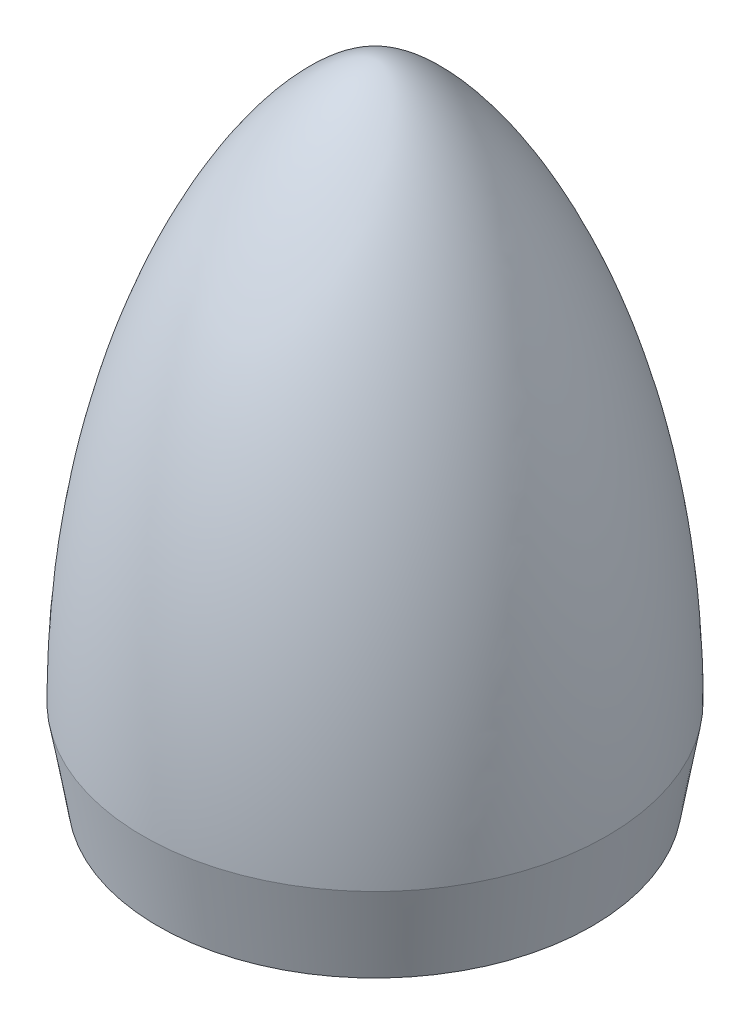
ISO-10303-21;
HEADER;
FILE_DESCRIPTION(('STEP AP214'),'2;1');
FILE_NAME('part.step','',(''),(''),'','','');
FILE_SCHEMA(('AUTOMOTIVE_DESIGN { 1 0 10303 214 1 1 1 1 }'));
ENDSEC;
DATA;
#1=APPLICATION_CONTEXT('core data for automotive mechanical design processes');
#2=APPLICATION_PROTOCOL_DEFINITION('international standard','automotive_design',2000,#1);
#3=PRODUCT_CONTEXT('',#1,'mechanical');
#4=PRODUCT('Part','Part','',(#3));
#5=PRODUCT_RELATED_PRODUCT_CATEGORY('part','',(#4));
#6=PRODUCT_DEFINITION_FORMATION('','',#4);
#7=PRODUCT_DEFINITION_CONTEXT('part definition',#1,'design');
#8=PRODUCT_DEFINITION('design','',#6,#7);
#9=PRODUCT_DEFINITION_SHAPE('','',#8);
#10=(LENGTH_UNIT() NAMED_UNIT(*) SI_UNIT(.MILLI.,.METRE.));
#11=(NAMED_UNIT(*) PLANE_ANGLE_UNIT() SI_UNIT($,.RADIAN.));
#12=(NAMED_UNIT(*) SI_UNIT($,.STERADIAN.) SOLID_ANGLE_UNIT());
#13=UNCERTAINTY_MEASURE_WITH_UNIT(LENGTH_MEASURE(1.E-05),#10,'distance_accuracy_value','');
#14=(GEOMETRIC_REPRESENTATION_CONTEXT(3) GLOBAL_UNCERTAINTY_ASSIGNED_CONTEXT((#13)) GLOBAL_UNIT_ASSIGNED_CONTEXT((#10,
#11,#12)) REPRESENTATION_CONTEXT('',''));
#15=CARTESIAN_POINT('',(0.,0.,0.));
#16=DIRECTION('',(0.,0.,1.));
#17=DIRECTION('',(1.,0.,0.));
#18=AXIS2_PLACEMENT_3D('',#15,#16,#17);
#19=CARTESIAN_POINT('',(0.,75.,0.));
#20=CARTESIAN_POINT('',(8.33333333333328,75.,0.));
#21=CARTESIAN_POINT('',(27.125,50.0000000000008,0.));
#22=CARTESIAN_POINT('',(27.125,9.99999999999995,0.));
#23=(BOUNDED_CURVE() B_SPLINE_CURVE(3,(#19,#20,#21,#22),.UNSPECIFIED.,.F.,
.F.) B_SPLINE_CURVE_WITH_KNOTS((4,4),(0.,1.),
.UNSPECIFIED.) CURVE() GEOMETRIC_REPRESENTATION_ITEM() RATIONAL_B_SPLINE_CURVE((1.,1.,1.,1.)) REPRESENTATION_ITEM(''));
#24=CARTESIAN_POINT('',(0.,75.,0.));
#25=DIRECTION('',(0.,-1.,0.));
#26=AXIS1_PLACEMENT('',#24,#25);
#27=SURFACE_OF_REVOLUTION('',#23,#26);
#28=OFFSET_SURFACE('',#27,-1.2,.F.);
#29=CARTESIAN_POINT('',(25.9056636611952,10.1039640318344,-1.00000000000001));
#30=CARTESIAN_POINT('',(25.9047739578221,11.1851292994955,-1.));
#31=CARTESIAN_POINT('',(25.89000684149,12.2662989602197,-1.));
#32=CARTESIAN_POINT('',(25.8321269391625,14.4301177234149,-0.999999999999999));
#33=CARTESIAN_POINT('',(25.7889555122232,15.5127652525866,-1.));
#34=CARTESIAN_POINT('',(25.6735874780133,17.678174263199,-1.));
#35=CARTESIAN_POINT('',(25.6013467457442,18.7609334047759,-1.));
#36=CARTESIAN_POINT('',(25.4272065567868,20.9251916612601,-1.));
#37=CARTESIAN_POINT('',(25.3252766279566,22.0066883296057,-1.));
#38=CARTESIAN_POINT('',(25.0911603567957,24.1670535457131,-1.));
#39=CARTESIAN_POINT('',(24.9589562111186,25.2459201680282,-1.));
#40=CARTESIAN_POINT('',(24.6637161605705,27.3996566798357,-1.));
#41=CARTESIAN_POINT('',(24.5006739761449,28.4745257097628,-1.));
#42=CARTESIAN_POINT('',(24.1396696088238,30.6400005591051,-1.));
#43=CARTESIAN_POINT('',(23.9410869927761,31.7305031577274,-1.));
#44=CARTESIAN_POINT('',(23.5106363113291,33.9045338260615,-1.));
#45=CARTESIAN_POINT('',(23.2787798575827,34.9880641916387,-1.));
#46=CARTESIAN_POINT('',(22.7810934389629,37.1467220348923,-1.));
#47=CARTESIAN_POINT('',(22.5152809145772,38.2218535276659,-1.));
#48=CARTESIAN_POINT('',(21.9488971595372,40.3622612287423,-1.));
#49=CARTESIAN_POINT('',(21.6483464406465,41.4275428557591,-1.));
#50=CARTESIAN_POINT('',(21.0115483611324,43.5467523215895,-0.999999999999999));
#51=CARTESIAN_POINT('',(20.6753208661929,44.6006861227439,-0.999999999999996));
#52=CARTESIAN_POINT('',(19.965988792542,46.695669129248,-1.));
#53=CARTESIAN_POINT('',(19.5928981302708,47.7367230312216,-1.00000000000002));
#54=CARTESIAN_POINT('',(18.9111355524333,49.5333072519622,-1.00000000000001));
#55=CARTESIAN_POINT('',(18.6112058890406,50.2921637450608,-1.));
#56=CARTESIAN_POINT('',(17.9897302408316,51.8009916872855,-0.999999999999997));
#57=CARTESIAN_POINT('',(17.6681842744349,52.5509631439819,-0.999999999999999));
#58=CARTESIAN_POINT('',(17.0025836747346,54.0410356529342,-1.));
#59=CARTESIAN_POINT('',(16.6585247368446,54.7811347847961,-1.));
#60=CARTESIAN_POINT('',(15.9467460013647,56.250376597967,-1.));
#61=CARTESIAN_POINT('',(15.5790136034461,56.9795131854377,-1.));
#62=CARTESIAN_POINT('',(14.8196738010202,58.4231147454467,-1.));
#63=CARTESIAN_POINT('',(14.4281238366581,59.1376098628833,-1.));
#64=CARTESIAN_POINT('',(13.6188223789997,60.5515715118866,-1.));
#65=CARTESIAN_POINT('',(13.2010725008175,61.2510389662835,-1.));
#66=CARTESIAN_POINT('',(12.337579357666,62.6318971885688,-1.));
#67=CARTESIAN_POINT('',(11.8918560160628,63.3133003411462,-1.));
#68=CARTESIAN_POINT('',(11.2002241923074,64.3191585320373,-1.));
#69=CARTESIAN_POINT('',(10.965922598767,64.6516266800612,-1.));
#70=CARTESIAN_POINT('',(10.489138756856,65.3106370330911,-1.));
#71=CARTESIAN_POINT('',(10.2466568465202,65.6371794821092,-1.));
#72=CARTESIAN_POINT('',(9.72104670420797,66.3254689731988,-1.));
#73=CARTESIAN_POINT('',(9.4367195090532,66.6863027051402,-1.));
#74=CARTESIAN_POINT('',(8.85602267824055,67.3982550839268,-1.));
#75=CARTESIAN_POINT('',(8.55965140573687,67.7493723992929,-1.));
#76=CARTESIAN_POINT('',(7.95353890224973,68.440374122446,-1.));
#77=CARTESIAN_POINT('',(7.64378763282018,68.7802497462721,-1.));
#78=CARTESIAN_POINT('',(7.0110636562642,69.4446905939281,-1.));
#79=CARTESIAN_POINT('',(6.68815587131408,69.7693171824537,-1.));
#80=CARTESIAN_POINT('',(6.19163053242581,70.2433321308816,-1.));
#81=CARTESIAN_POINT('',(6.02413242772628,70.3991505871125,-1.));
#82=CARTESIAN_POINT('',(5.68475706169596,70.7059348156969,-1.));
#83=CARTESIAN_POINT('',(5.51288010206683,70.8569009207637,-1.));
#84=CARTESIAN_POINT('',(5.16460709759994,71.1531207675309,-1.));
#85=CARTESIAN_POINT('',(4.9882165543557,71.2983809631444,-1.));
#86=CARTESIAN_POINT('',(4.63035021829058,71.5824712691468,-1.));
#87=CARTESIAN_POINT('',(4.44887502174878,71.7213021284827,-1.));
#88=CARTESIAN_POINT('',(4.07540057186857,71.995035449687,-1.));
#89=CARTESIAN_POINT('',(3.88324954641722,72.1297318940581,-1.));
#90=CARTESIAN_POINT('',(3.49244950352492,72.3895028121724,-1.));
#91=CARTESIAN_POINT('',(3.29379878285523,72.5145747345833,-1.));
#92=CARTESIAN_POINT('',(2.88918360745163,72.7528426831985,-1.));
#93=CARTESIAN_POINT('',(2.68321341586992,72.8660291062032,-1.));
#94=CARTESIAN_POINT('',(2.36847365439432,73.0241557935636,-1.));
#95=CARTESIAN_POINT('',(2.26261668941317,73.0749141151302,-1.));
#96=CARTESIAN_POINT('',(2.04887880663898,73.1719570760407,-1.));
#97=CARTESIAN_POINT('',(1.940998184409,73.2182423627067,-1.));
#98=CARTESIAN_POINT('',(1.70958409607399,73.3110666657054,-1.));
#99=CARTESIAN_POINT('',(1.58577330785383,73.3569205617637,-1.));
#100=CARTESIAN_POINT('',(1.33553827622287,73.4407502162384,-1.));
#101=CARTESIAN_POINT('',(1.20911511620819,73.478729171181,-1.));
#102=CARTESIAN_POINT('',(0.954495143604121,73.5449874784573,-1.));
#103=CARTESIAN_POINT('',(0.82631283312375,73.5733217023708,-1.));
#104=CARTESIAN_POINT('',(0.567938063143574,73.6186376117928,-1.));
#105=CARTESIAN_POINT('',(0.43774643034824,73.6356238452357,-1.));
#106=CARTESIAN_POINT('',(0.218728150607686,73.6531232062654,-1.));
#107=CARTESIAN_POINT('',(0.130178735759265,73.6571920582875,-1.));
#108=CARTESIAN_POINT('',(-0.047018203675013,73.6591241864253,-1.));
#109=CARTESIAN_POINT('',(-0.135665748312728,73.6569857845799,-1.));
#110=CARTESIAN_POINT('',(-0.312584033550978,73.6466295228109,-1.));
#111=CARTESIAN_POINT('',(-0.400854827213615,73.6384125494652,-1.));
#112=CARTESIAN_POINT('',(-0.577099842838167,73.6162956347007,-1.));
#113=CARTESIAN_POINT('',(-0.665070626945435,73.6023686997567,-1.));
#114=CARTESIAN_POINT('',(-0.840061090438921,73.5694229016164,-1.));
#115=CARTESIAN_POINT('',(-0.927080575384761,73.5504030169788,-1.));
#116=CARTESIAN_POINT('',(-1.10002301297835,73.5078695150568,-1.));
#117=CARTESIAN_POINT('',(-1.18594570966977,73.4843548685721,-1.));
#118=CARTESIAN_POINT('',(-1.40673022816087,73.4184145302641,-1.));
#119=CARTESIAN_POINT('',(-1.54069942030774,73.3729927504121,-1.));
#120=CARTESIAN_POINT('',(-1.80561365348659,73.2740199013044,-1.));
#121=CARTESIAN_POINT('',(-1.93655745970379,73.2204655779885,-1.));
#122=CARTESIAN_POINT('',(-2.19549277557048,73.1066004889257,-1.));
#123=CARTESIAN_POINT('',(-2.32348358490336,73.0462881399459,-1.));
#124=CARTESIAN_POINT('',(-2.57692929880701,72.9198200623486,-1.));
#125=CARTESIAN_POINT('',(-2.70237704535331,72.8536500702756,-1.));
#126=CARTESIAN_POINT('',(-2.95051503245612,72.7164505838075,-1.));
#127=CARTESIAN_POINT('',(-3.07320628875075,72.6454229197673,-1.));
#128=CARTESIAN_POINT('',(-3.31602472845425,72.4991431940919,-0.999999999999999));
#129=CARTESIAN_POINT('',(-3.43615205408969,72.4238913676247,-0.999999999999998));
#130=CARTESIAN_POINT('',(-3.73186925446334,72.2321691026222,-0.999999999999997));
#131=CARTESIAN_POINT('',(-3.90600751278708,72.1134576963422,-0.999999999999999));
#132=CARTESIAN_POINT('',(-4.24943012223542,71.8691813477923,-1.));
#133=CARTESIAN_POINT('',(-4.41871353593966,71.7436150953328,-1.));
#134=CARTESIAN_POINT('',(-4.75302096460449,71.4864661521654,-1.));
#135=CARTESIAN_POINT('',(-4.91803858353854,71.3548751637407,-1.));
#136=CARTESIAN_POINT('',(-5.24390296385264,71.0866168062875,-1.));
#137=CARTESIAN_POINT('',(-5.40474936053582,70.9499489959081,-1.));
#138=CARTESIAN_POINT('',(-5.88166415507493,70.5331250220563,-1.));
#139=CARTESIAN_POINT('',(-6.19191858470839,70.2462961971445,-1.));
#140=CARTESIAN_POINT('',(-6.79975157706936,69.657613454898,-1.));
#141=CARTESIAN_POINT('',(-7.09728363795676,69.355711929589,-0.999999999999999));
#142=CARTESIAN_POINT('',(-7.67973284756207,68.7405711466745,-1.));
#143=CARTESIAN_POINT('',(-7.9646621474796,68.4273433637191,-1.));
#144=CARTESIAN_POINT('',(-8.52328004018828,67.7911716571157,-0.999999999999998));
#145=CARTESIAN_POINT('',(-8.79697107644563,67.4682298722628,-0.999999999999991));
#146=CARTESIAN_POINT('',(-9.33590363177225,66.8117095975805,-0.999999999999991));
#147=CARTESIAN_POINT('',(-9.60107517023614,66.4780737785493,-0.999999999999998));
#148=CARTESIAN_POINT('',(-10.1217661738688,65.8033321580894,-1.));
#149=CARTESIAN_POINT('',(-10.3772849916799,65.4622258580693,-1.));
#150=CARTESIAN_POINT('',(-10.8795251857571,64.7730663861623,-0.999999999999999));
#151=CARTESIAN_POINT('',(-11.1262372321172,64.4250064225771,-1.));
#152=CARTESIAN_POINT('',(-11.6111009251128,63.7229666090582,-1.));
#153=CARTESIAN_POINT('',(-11.8492521934796,63.3689864985454,-1.));
#154=CARTESIAN_POINT('',(-12.5519791123531,62.2983643790201,-1.));
#155=CARTESIAN_POINT('',(-13.0043617043104,61.573684856381,-1.));
#156=CARTESIAN_POINT('',(-13.8793440107584,60.1065602896436,-1.));
#157=CARTESIAN_POINT('',(-14.3019405208713,59.3641133456053,-1.));
#158=CARTESIAN_POINT('',(-15.1201327932036,57.8626961766781,-1.));
#159=CARTESIAN_POINT('',(-15.5156761540113,57.1036974418436,-1.));
#160=CARTESIAN_POINT('',(-16.2801739807046,55.5731996250319,-1.));
#161=CARTESIAN_POINT('',(-16.6491490689552,54.8017108202861,-1.));
#162=CARTESIAN_POINT('',(-17.3620078504334,53.2475126458075,-1.));
#163=CARTESIAN_POINT('',(-17.7058987392067,52.4648065715074,-1.));
#164=CARTESIAN_POINT('',(-18.3697238586118,50.8893041120879,-0.999999999999999));
#165=CARTESIAN_POINT('',(-18.6896576791083,50.0965075544952,-0.999999999999995));
#166=CARTESIAN_POINT('',(-19.3390138069924,48.4176674392677,-0.999999999999995));
#167=CARTESIAN_POINT('',(-19.6658625529707,47.5306277905871,-0.999999999999999));
#168=CARTESIAN_POINT('',(-20.2922338493814,45.7469322753983,-1.));
#169=CARTESIAN_POINT('',(-20.591754587495,44.850275775527,-1.));
#170=CARTESIAN_POINT('',(-21.4508779385059,42.1465358881882,-0.999999999999999));
#171=CARTESIAN_POINT('',(-21.9706672657314,40.3266575105739,-1.));
#172=CARTESIAN_POINT('',(-22.909147984305,36.6606518030047,-1.));
#173=CARTESIAN_POINT('',(-23.3278067697762,34.8145162099632,-1.));
#174=CARTESIAN_POINT('',(-24.067266847634,31.1056334834027,-1.));
#175=CARTESIAN_POINT('',(-24.388212143806,29.2429149996989,-1.));
#176=CARTESIAN_POINT('',(-24.9363194758353,25.5045655893478,-0.999999999999999));
#177=CARTESIAN_POINT('',(-25.1635179957877,23.6289399753363,-0.999999999999997));
#178=CARTESIAN_POINT('',(-25.5272649721468,19.8697478763604,-1.));
#179=CARTESIAN_POINT('',(-25.6638538506106,17.9861853100838,-1.00000000000001));
#180=CARTESIAN_POINT('',(-25.8058026113443,15.1012031574367,-1.00000000000001));
#181=CARTESIAN_POINT('',(-25.8426675421309,14.1012251756996,-1.));
#182=CARTESIAN_POINT('',(-25.892168124827,12.1021648156403,-0.999999999999998));
#183=CARTESIAN_POINT('',(-25.9048399402877,11.1030833353799,-0.999999999999998));
#184=CARTESIAN_POINT('',(-25.9056636611953,10.1039640318345,-1.00000000000001));
#185=B_SPLINE_CURVE_WITH_KNOTS('',3,(#29,#30,#31,#32,#33,#34,#35,#36,#37,#38,#39,#40,#41,#42,
#43,#44,#45,#46,#47,#48,#49,#50,#51,#52,#53,#54,#55,#56,#57,#58,#59,#60,#61,#62,#63,#64,#65,#66,
#67,#68,#69,#70,#71,#72,#73,#74,#75,#76,#77,#78,#79,#80,#81,#82,#83,#84,#85,#86,#87,#88,#89,#90,
#91,#92,#93,#94,#95,#96,#97,#98,#99,#100,#101,#102,#103,#104,#105,#106,#107,#108,#109,#110,#111,
#112,#113,#114,#115,#116,#117,#118,#119,#120,#121,#122,#123,#124,#125,#126,#127,#128,#129,#130,
#131,#132,#133,#134,#135,#136,#137,#138,#139,#140,#141,#142,#143,#144,#145,#146,#147,#148,#149,
#150,#151,#152,#153,#154,#155,#156,#157,#158,#159,#160,#161,#162,#163,#164,#165,#166,#167,#168,
#169,#170,#171,#172,#173,#174,#175,#176,#177,#178,#179,#180,#181,#182,#183,#184),.UNSPECIFIED.,
.F.,.F.,(4,2,2,2,2,2,2,2,2,2,2,2,2,2,2,2,2,2,2,2,2,2,2,2,2,2,2,2,2,2,2,2,2,2,2,2,2,2,2,2,2,2,2,
2,2,2,2,2,2,2,2,2,2,2,2,2,2,2,2,2,2,2,2,2,2,2,2,2,2,2,2,2,2,2,2,2,2,4),(0.,3.24343134704531,
6.49357988613179,9.74868062711808,13.0071341545255,16.2675088227669,19.5285481177859,
22.8533478498203,26.1769901270554,29.498932130469,32.8189225614627,36.1370739480751,
39.4539774307464,41.9016111418468,44.349242767327,46.7973437668715,49.2467587305887,
51.6904842682368,54.1340593083097,56.5759133039602,57.7960118315539,59.0160600026595,
60.3940081421391,61.7721441815512,63.1513327742664,64.5243880409892,65.2106182880003,
65.8968013811639,66.5821845712025,67.2674877197739,67.9712185598519,68.6751353115033,
69.3796165043649,69.7317252285196,70.0837829201708,70.4796491776574,70.8753544326922,
71.2687692341426,71.6620262719995,71.9277538941818,72.1935533552387,72.4593140562878,
72.7263458845738,72.9934313088965,73.2605779632437,73.6846096230189,74.1088113990799,
74.5331127634053,74.9584773281655,75.383682490699,75.808864004589,76.4409111436386,
77.0730795138123,77.7061464081936,78.3392684673153,79.60623277733,80.8774891109489,
82.1474917579855,83.4172167980665,84.6955622384382,85.9739932591348,87.2537407157062,
88.5335446501961,91.0955358893072,93.6578023273025,96.2248989441194,98.7899810004027,
101.354324330753,103.918711551582,106.754244324794,109.589965006329,115.264535718191,
120.94093355499,126.608924934009,132.274708375508,137.937962539655,140.939679555536,
143.936906120474),.UNSPECIFIED.);
#186=CARTESIAN_POINT('',(25.9056636611952,10.1039640318344,-1.));
#187=VERTEX_POINT('',#186);
#188=CARTESIAN_POINT('',(-25.9056636611953,10.1039640318344,-1.));
#189=VERTEX_POINT('',#188);
#190=EDGE_CURVE('E241',#187,#189,#185,.T.);
#191=ORIENTED_EDGE('',*,*,#190,.T.);
#192=CARTESIAN_POINT('',(0.,10.1039640318344,0.));
#193=DIRECTION('',(0.,-1.,0.));
#194=DIRECTION('',(1.,0.,0.));
#195=AXIS2_PLACEMENT_3D('',#192,#193,#194);
#196=CIRCLE('',#195,25.9249572753162);
#197=EDGE_CURVE('E257',#189,#187,#196,.T.);
#198=ORIENTED_EDGE('',*,*,#197,.T.);
#199=EDGE_LOOP('',(#191,#198));
#200=FACE_BOUND('',#199,.T.);
#201=ADVANCED_FACE('F41',(#200),#28,.F.);
#202=CARTESIAN_POINT('',(0.,0.,0.));
#203=DIRECTION('',(0.,-1.,0.));
#204=DIRECTION('',(1.,0.,0.));
#205=AXIS2_PLACEMENT_3D('',#202,#203,#204);
#206=CONICAL_SURFACE('',#205,25.375,1.39755066034253);
#207=CARTESIAN_POINT('',(0.,0.206856398102697,0.));
#208=DIRECTION('',(0.,1.,0.));
#209=DIRECTION('',(-1.,0.,0.));
#210=AXIS2_PLACEMENT_3D('',#207,#208,#209);
#211=CIRCLE('',#210,24.1929634394132);
#212=CARTESIAN_POINT('',(-24.1929634394132,0.206856398102694,0.));
#213=VERTEX_POINT('',#212);
#214=EDGE_CURVE('E11',#213,#213,#211,.F.);
#215=ORIENTED_EDGE('',*,*,#214,.F.);
#216=EDGE_LOOP('',(#215));
#217=FACE_BOUND('',#216,.T.);
#218=CARTESIAN_POINT('',(0.,0.,0.));
#219=DIRECTION('',(0.,-1.,0.));
#220=DIRECTION('',(1.,0.,0.));
#221=AXIS2_PLACEMENT_3D('',#218,#219,#220);
#222=CIRCLE('',#221,25.375);
#223=CARTESIAN_POINT('',(25.375,0.,0.));
#224=VERTEX_POINT('',#223);
#225=EDGE_CURVE('E249',#224,#224,#222,.T.);
#226=ORIENTED_EDGE('',*,*,#225,.T.);
#227=EDGE_LOOP('',(#226));
#228=FACE_BOUND('',#227,.T.);
#229=ADVANCED_FACE('F43',(#217,#228),#206,.F.);
#230=CARTESIAN_POINT('',(0.,10.2068563981027,0.));
#231=DIRECTION('',(0.,1.,0.));
#232=DIRECTION('',(-1.,0.,0.));
#233=AXIS2_PLACEMENT_3D('',#230,#231,#232);
#234=CONICAL_SURFACE('',#233,25.9429634394132,0.173245666452364);
#235=ORIENTED_EDGE('',*,*,#214,.T.);
#236=EDGE_LOOP('',(#235));
#237=FACE_BOUND('',#236,.T.);
#238=CARTESIAN_POINT('',(25.9056636611952,10.1039640318344,1.));
#239=VERTEX_POINT('',#238);
#240=CARTESIAN_POINT('',(-25.9056636611953,10.1039640318344,1.));
#241=VERTEX_POINT('',#240);
#242=EDGE_CURVE('E56',#239,#241,#196,.T.);
#243=ORIENTED_EDGE('',*,*,#242,.F.);
#244=CARTESIAN_POINT('',(0.,10.1039640318344,0.));
#245=DIRECTION('',(0.,-1.,0.));
#246=DIRECTION('',(1.,0.,0.));
#247=AXIS2_PLACEMENT_3D('',#244,#245,#246);
#248=CIRCLE('',#247,25.9249572753162);
#249=EDGE_CURVE('E232',#187,#239,#248,.T.);
#250=ORIENTED_EDGE('',*,*,#249,.F.);
#251=ORIENTED_EDGE('',*,*,#197,.F.);
#252=CARTESIAN_POINT('',(0.,10.1039640318344,0.));
#253=DIRECTION('',(0.,-1.,0.));
#254=DIRECTION('',(1.,0.,0.));
#255=AXIS2_PLACEMENT_3D('',#252,#253,#254);
#256=CIRCLE('',#255,25.9249572753162);
#257=EDGE_CURVE('E243',#241,#189,#256,.T.);
#258=ORIENTED_EDGE('',*,*,#257,.F.);
#259=EDGE_LOOP('',(#243,#250,#251,#258));
#260=FACE_BOUND('',#259,.T.);
#261=ADVANCED_FACE('F269',(#237,#260),#234,.F.);
#262=CARTESIAN_POINT('',(-25.9056636611953,10.1039640318344,0.999999999999999));
#263=CARTESIAN_POINT('',(-25.9047739578221,11.1851292994955,1.));
#264=CARTESIAN_POINT('',(-25.89000684149,12.2662989602197,1.));
#265=CARTESIAN_POINT('',(-25.8321269391625,14.4301177234149,1.));
#266=CARTESIAN_POINT('',(-25.7889555122233,15.5127652525866,1.));
#267=CARTESIAN_POINT('',(-25.6735874780133,17.678174263199,1.));
#268=CARTESIAN_POINT('',(-25.6013467457442,18.7609334047759,1.));
#269=CARTESIAN_POINT('',(-25.4272065567868,20.9251916612601,1.));
#270=CARTESIAN_POINT('',(-25.3252766279566,22.0066883296057,1.));
#271=CARTESIAN_POINT('',(-25.0911603567957,24.1670535457131,1.));
#272=CARTESIAN_POINT('',(-24.9589562111186,25.2459201680282,1.));
#273=CARTESIAN_POINT('',(-24.6637161605705,27.3996566798357,1.));
#274=CARTESIAN_POINT('',(-24.5006739761449,28.4745257097628,1.));
#275=CARTESIAN_POINT('',(-24.1396696088238,30.6400005591052,1.));
#276=CARTESIAN_POINT('',(-23.9410869927761,31.7305031577274,1.));
#277=CARTESIAN_POINT('',(-23.5106363113291,33.9045338260615,1.));
#278=CARTESIAN_POINT('',(-23.2787798575827,34.9880641916387,1.));
#279=CARTESIAN_POINT('',(-22.7810934389629,37.1467220348923,1.));
#280=CARTESIAN_POINT('',(-22.5152809145772,38.2218535276659,1.));
#281=CARTESIAN_POINT('',(-21.9488971595372,40.3622612287423,1.));
#282=CARTESIAN_POINT('',(-21.6483464406465,41.4275428557591,0.999999999999999));
#283=CARTESIAN_POINT('',(-21.0115483611324,43.5467523215895,1.));
#284=CARTESIAN_POINT('',(-20.6753208661929,44.6006861227439,1.));
#285=CARTESIAN_POINT('',(-19.965988792542,46.695669129248,0.999999999999998));
#286=CARTESIAN_POINT('',(-19.5928981302708,47.7367230312216,0.999999999999992));
#287=CARTESIAN_POINT('',(-18.9111355524333,49.5333072519622,0.999999999999994));
#288=CARTESIAN_POINT('',(-18.6112058890406,50.2921637450608,0.999999999999998));
#289=CARTESIAN_POINT('',(-17.9897302408317,51.8009916872854,1.));
#290=CARTESIAN_POINT('',(-17.6681842744349,52.5509631439819,1.));
#291=CARTESIAN_POINT('',(-17.0025836747346,54.0410356529342,1.));
#292=CARTESIAN_POINT('',(-16.6585247368446,54.781134784796,1.));
#293=CARTESIAN_POINT('',(-15.9467460013648,56.250376597967,1.));
#294=CARTESIAN_POINT('',(-15.5790136034461,56.9795131854377,1.));
#295=CARTESIAN_POINT('',(-14.8196738010202,58.4231147454467,1.));
#296=CARTESIAN_POINT('',(-14.4281238366582,59.1376098628832,1.));
#297=CARTESIAN_POINT('',(-13.6188223789998,60.5515715118866,1.));
#298=CARTESIAN_POINT('',(-13.2010725008175,61.2510389662835,1.));
#299=CARTESIAN_POINT('',(-12.337579357666,62.6318971885688,1.));
#300=CARTESIAN_POINT('',(-11.8918560160629,63.3133003411462,0.999999999999999));
#301=CARTESIAN_POINT('',(-11.2002241923074,64.3191585320372,1.));
#302=CARTESIAN_POINT('',(-10.9659225987671,64.6516266800612,1.));
#303=CARTESIAN_POINT('',(-10.489138756856,65.3106370330911,0.999999999999999));
#304=CARTESIAN_POINT('',(-10.2466568465203,65.6371794821092,0.999999999999996));
#305=CARTESIAN_POINT('',(-9.72104670420803,66.3254689731988,0.999999999999995));
#306=CARTESIAN_POINT('',(-9.43671950905325,66.6863027051402,0.999999999999999));
#307=CARTESIAN_POINT('',(-8.85602267824058,67.3982550839268,1.));
#308=CARTESIAN_POINT('',(-8.55965140573689,67.7493723992929,1.));
#309=CARTESIAN_POINT('',(-7.95353890224975,68.440374122446,1.));
#310=CARTESIAN_POINT('',(-7.6437876328202,68.7802497462721,1.));
#311=CARTESIAN_POINT('',(-7.01106365626423,69.4446905939282,1.));
#312=CARTESIAN_POINT('',(-6.6881558713141,69.7693171824538,1.));
#313=CARTESIAN_POINT('',(-6.19163053242581,70.2433321308817,1.));
#314=CARTESIAN_POINT('',(-6.02413242772626,70.3991505871125,1.));
#315=CARTESIAN_POINT('',(-5.68475706169594,70.705934815697,1.));
#316=CARTESIAN_POINT('',(-5.51288010206683,70.8569009207637,1.));
#317=CARTESIAN_POINT('',(-5.16460709759995,71.153120767531,1.));
#318=CARTESIAN_POINT('',(-4.98821655435571,71.2983809631445,1.));
#319=CARTESIAN_POINT('',(-4.63035021829058,71.5824712691469,1.));
#320=CARTESIAN_POINT('',(-4.44887502174878,71.7213021284827,1.));
#321=CARTESIAN_POINT('',(-4.07540057186857,71.995035449687,1.));
#322=CARTESIAN_POINT('',(-3.88324954641723,72.1297318940582,1.));
#323=CARTESIAN_POINT('',(-3.49244950352493,72.3895028121724,1.));
#324=CARTESIAN_POINT('',(-3.29379878285524,72.5145747345833,1.));
#325=CARTESIAN_POINT('',(-2.88918360745165,72.7528426831985,1.));
#326=CARTESIAN_POINT('',(-2.68321341586995,72.8660291062033,1.));
#327=CARTESIAN_POINT('',(-2.36847365439435,73.0241557935636,1.));
#328=CARTESIAN_POINT('',(-2.26261668941321,73.0749141151302,1.));
#329=CARTESIAN_POINT('',(-2.04887880663903,73.1719570760407,1.));
#330=CARTESIAN_POINT('',(-1.94099818440906,73.2182423627066,1.));
#331=CARTESIAN_POINT('',(-1.70958409607405,73.3110666657054,1.));
#332=CARTESIAN_POINT('',(-1.5857733078539,73.3569205617637,1.));
#333=CARTESIAN_POINT('',(-1.33553827622293,73.4407502162384,1.));
#334=CARTESIAN_POINT('',(-1.20911511620825,73.478729171181,1.));
#335=CARTESIAN_POINT('',(-0.954495143604182,73.5449874784573,1.));
#336=CARTESIAN_POINT('',(-0.826312833123813,73.5733217023708,1.));
#337=CARTESIAN_POINT('',(-0.567938063143639,73.6186376117928,1.));
#338=CARTESIAN_POINT('',(-0.437746430348303,73.6356238452357,1.));
#339=CARTESIAN_POINT('',(-0.218728150607749,73.6531232062654,1.));
#340=CARTESIAN_POINT('',(-0.130178735759329,73.6571920582875,1.));
#341=CARTESIAN_POINT('',(0.047018203674949,73.6591241864253,1.));
#342=CARTESIAN_POINT('',(0.135665748312664,73.6569857845799,1.));
#343=CARTESIAN_POINT('',(0.312584033550914,73.6466295228109,1.));
#344=CARTESIAN_POINT('',(0.400854827213552,73.6384125494652,1.));
#345=CARTESIAN_POINT('',(0.5770998428381,73.6162956347007,1.));
#346=CARTESIAN_POINT('',(0.665070626945363,73.6023686997567,1.));
#347=CARTESIAN_POINT('',(0.840061090438851,73.5694229016164,1.));
#348=CARTESIAN_POINT('',(0.927080575384697,73.5504030169788,1.));
#349=CARTESIAN_POINT('',(1.10002301297829,73.5078695150568,1.));
#350=CARTESIAN_POINT('',(1.1859457096697,73.4843548685721,0.999999999999999));
#351=CARTESIAN_POINT('',(1.4067302281608,73.4184145302641,0.999999999999999));
#352=CARTESIAN_POINT('',(1.54069942030767,73.3729927504121,1.));
#353=CARTESIAN_POINT('',(1.80561365348652,73.2740199013044,1.));
#354=CARTESIAN_POINT('',(1.93655745970371,73.2204655779885,1.));
#355=CARTESIAN_POINT('',(2.1954927755704,73.1066004889257,1.));
#356=CARTESIAN_POINT('',(2.32348358490328,73.0462881399459,1.));
#357=CARTESIAN_POINT('',(2.57692929880695,72.9198200623486,1.));
#358=CARTESIAN_POINT('',(2.70237704535324,72.8536500702756,1.));
#359=CARTESIAN_POINT('',(2.95051503245606,72.7164505838075,1.));
#360=CARTESIAN_POINT('',(3.07320628875069,72.6454229197674,1.));
#361=CARTESIAN_POINT('',(3.31602472845418,72.4991431940919,1.));
#362=CARTESIAN_POINT('',(3.43615205408962,72.4238913676247,1.));
#363=CARTESIAN_POINT('',(3.73186925446326,72.2321691026222,1.));
#364=CARTESIAN_POINT('',(3.90600751278701,72.1134576963423,1.));
#365=CARTESIAN_POINT('',(4.24943012223535,71.8691813477923,1.));
#366=CARTESIAN_POINT('',(4.41871353593959,71.7436150953329,1.));
#367=CARTESIAN_POINT('',(4.75302096460441,71.4864661521654,1.));
#368=CARTESIAN_POINT('',(4.91803858353846,71.3548751637407,1.));
#369=CARTESIAN_POINT('',(5.24390296385255,71.0866168062875,1.));
#370=CARTESIAN_POINT('',(5.40474936053573,70.9499489959082,1.));
#371=CARTESIAN_POINT('',(5.88166415507484,70.5331250220563,1.));
#372=CARTESIAN_POINT('',(6.1919185847083,70.2462961971445,1.));
#373=CARTESIAN_POINT('',(6.79975157706926,69.657613454898,1.));
#374=CARTESIAN_POINT('',(7.09728363795667,69.3557119295891,1.));
#375=CARTESIAN_POINT('',(7.67973284756197,68.7405711466746,1.));
#376=CARTESIAN_POINT('',(7.96466214747948,68.4273433637192,1.));
#377=CARTESIAN_POINT('',(8.52328004018814,67.7911716571158,0.999999999999998));
#378=CARTESIAN_POINT('',(8.79697107644551,67.4682298722629,0.999999999999993));
#379=CARTESIAN_POINT('',(9.33590363177214,66.8117095975807,0.999999999999993));
#380=CARTESIAN_POINT('',(9.60107517023603,66.4780737785494,0.999999999999998));
#381=CARTESIAN_POINT('',(10.1217661738687,65.8033321580895,1.));
#382=CARTESIAN_POINT('',(10.3772849916798,65.4622258580694,1.));
#383=CARTESIAN_POINT('',(10.879525185757,64.7730663861624,1.));
#384=CARTESIAN_POINT('',(11.1262372321171,64.4250064225772,1.));
#385=CARTESIAN_POINT('',(11.6111009251127,63.7229666090583,1.));
#386=CARTESIAN_POINT('',(11.8492521934795,63.3689864985455,1.));
#387=CARTESIAN_POINT('',(12.551979112353,62.2983643790203,1.));
#388=CARTESIAN_POINT('',(13.0043617043103,61.5736848563812,1.));
#389=CARTESIAN_POINT('',(13.8793440107582,60.1065602896438,1.));
#390=CARTESIAN_POINT('',(14.3019405208712,59.3641133456055,1.));
#391=CARTESIAN_POINT('',(15.1201327932035,57.8626961766783,1.));
#392=CARTESIAN_POINT('',(15.5156761540112,57.1036974418438,1.));
#393=CARTESIAN_POINT('',(16.2801739807044,55.5731996250322,1.));
#394=CARTESIAN_POINT('',(16.6491490689551,54.8017108202863,1.));
#395=CARTESIAN_POINT('',(17.3620078504333,53.2475126458078,1.));
#396=CARTESIAN_POINT('',(17.7058987392066,52.4648065715077,1.));
#397=CARTESIAN_POINT('',(18.3697238586116,50.8893041120881,1.));
#398=CARTESIAN_POINT('',(18.6896576791081,50.0965075544954,1.));
#399=CARTESIAN_POINT('',(19.3390138069923,48.4176674392679,1.));
#400=CARTESIAN_POINT('',(19.6658625529705,47.5306277905874,1.));
#401=CARTESIAN_POINT('',(20.2922338493813,45.7469322753986,1.));
#402=CARTESIAN_POINT('',(20.5917545874949,44.8502757755273,1.));
#403=CARTESIAN_POINT('',(21.4508779385058,42.1465358881885,1.));
#404=CARTESIAN_POINT('',(21.9706672657312,40.3266575105743,1.));
#405=CARTESIAN_POINT('',(22.9091479843049,36.6606518030051,1.));
#406=CARTESIAN_POINT('',(23.3278067697761,34.8145162099636,1.));
#407=CARTESIAN_POINT('',(24.067266847634,31.105633483403,1.));
#408=CARTESIAN_POINT('',(24.388212143806,29.2429149996993,1.));
#409=CARTESIAN_POINT('',(24.9363194758352,25.5045655893482,1.));
#410=CARTESIAN_POINT('',(25.1635179957876,23.6289399753368,1.));
#411=CARTESIAN_POINT('',(25.5272649721467,19.8697478763609,1.));
#412=CARTESIAN_POINT('',(25.6638538506106,17.9861853100843,1.));
#413=CARTESIAN_POINT('',(25.8058026113443,15.1012031574371,1.));
#414=CARTESIAN_POINT('',(25.8426675421308,14.1012251756999,1.));
#415=CARTESIAN_POINT('',(25.892168124827,12.1021648156405,1.));
#416=CARTESIAN_POINT('',(25.9048399402877,11.10308333538,1.));
#417=CARTESIAN_POINT('',(25.9056636611952,10.1039640318345,1.));
#418=B_SPLINE_CURVE_WITH_KNOTS('',3,(#262,#263,#264,#265,#266,#267,#268,#269,#270,#271,#272,
#273,#274,#275,#276,#277,#278,#279,#280,#281,#282,#283,#284,#285,#286,#287,#288,#289,#290,#291,
#292,#293,#294,#295,#296,#297,#298,#299,#300,#301,#302,#303,#304,#305,#306,#307,#308,#309,#310,
#311,#312,#313,#314,#315,#316,#317,#318,#319,#320,#321,#322,#323,#324,#325,#326,#327,#328,#329,
#330,#331,#332,#333,#334,#335,#336,#337,#338,#339,#340,#341,#342,#343,#344,#345,#346,#347,#348,
#349,#350,#351,#352,#353,#354,#355,#356,#357,#358,#359,#360,#361,#362,#363,#364,#365,#366,#367,
#368,#369,#370,#371,#372,#373,#374,#375,#376,#377,#378,#379,#380,#381,#382,#383,#384,#385,#386,
#387,#388,#389,#390,#391,#392,#393,#394,#395,#396,#397,#398,#399,#400,#401,#402,#403,#404,#405,
#406,#407,#408,#409,#410,#411,#412,#413,#414,#415,#416,#417),.UNSPECIFIED.,.F.,.F.,(4,2,2,2,2,2,
2,2,2,2,2,2,2,2,2,2,2,2,2,2,2,2,2,2,2,2,2,2,2,2,2,2,2,2,2,2,2,2,2,2,2,2,2,2,2,2,2,2,2,2,2,2,2,2,
2,2,2,2,2,2,2,2,2,2,2,2,2,2,2,2,2,2,2,2,2,2,2,4),(0.,3.24343134704531,6.4935798861318,
9.7486806271181,13.0071341545255,16.2675088227669,19.528548117786,22.8533478498204,
26.1769901270554,29.498932130469,32.8189225614627,36.1370739480751,39.4539774307464,
41.9016111418468,44.3492427673269,46.7973437668715,49.2467587305887,51.6904842682368,
54.1340593083096,56.5759133039602,57.7960118315539,59.0160600026595,60.3940081421391,
61.7721441815512,63.1513327742664,64.5243880409893,65.2106182880003,65.896801381164,
66.5821845712026,67.2674877197739,67.9712185598519,68.6751353115033,69.3796165043648,
69.7317252285196,70.0837829201708,70.4796491776574,70.8753544326921,71.2687692341426,
71.6620262719994,71.9277538941818,72.1935533552387,72.4593140562877,72.7263458845738,
72.9934313088964,73.2605779632436,73.6846096230189,74.1088113990799,74.5331127634053,
74.9584773281655,75.3836824906989,75.8088640045889,76.4409111436386,77.0730795138122,
77.7061464081935,78.3392684673153,79.60623277733,80.8774891109488,82.1474917579854,
83.4172167980663,84.695562238438,85.9739932591346,87.253740715706,88.5335446501959,
91.095535889307,93.6578023273022,96.2248989441191,98.7899810004024,101.354324330753,
103.918711551582,106.754244324793,109.589965006329,115.264535718191,120.94093355499,
126.608924934009,132.274708375507,137.937962539654,140.939679555536,143.936906120474),.UNSPECIFIED.);
#419=EDGE_CURVE('E230',#241,#239,#418,.T.);
#420=ORIENTED_EDGE('',*,*,#419,.T.);
#421=ORIENTED_EDGE('',*,*,#242,.T.);
#422=EDGE_LOOP('',(#420,#421));
#423=FACE_BOUND('',#422,.T.);
#424=ADVANCED_FACE('F267',(#423),#28,.F.);
#425=CARTESIAN_POINT('',(0.,9.99999999999999,0.));
#426=DIRECTION('',(0.,1.,0.));
#427=DIRECTION('',(-1.,0.,0.));
#428=AXIS2_PLACEMENT_3D('',#425,#426,#427);
#429=CONICAL_SURFACE('',#428,27.125,0.173245666452364);
#430=ORIENTED_EDGE('',*,*,#225,.F.);
#431=EDGE_LOOP('',(#430));
#432=FACE_BOUND('',#431,.T.);
#433=CARTESIAN_POINT('',(0.,9.99999999999999,0.));
#434=DIRECTION('',(0.,-1.,0.));
#435=DIRECTION('',(1.,0.,0.));
#436=AXIS2_PLACEMENT_3D('',#433,#434,#435);
#437=CIRCLE('',#436,27.125);
#438=CARTESIAN_POINT('',(27.125,10.,0.));
#439=VERTEX_POINT('',#438);
#440=EDGE_CURVE('E242',#439,#439,#437,.T.);
#441=ORIENTED_EDGE('',*,*,#440,.T.);
#442=EDGE_LOOP('',(#441));
#443=FACE_BOUND('',#442,.T.);
#444=ADVANCED_FACE('F285',(#432,#443),#429,.T.);
#445=CARTESIAN_POINT('',(0.,75.,0.));
#446=CARTESIAN_POINT('',(8.33333333333328,75.,0.));
#447=CARTESIAN_POINT('',(27.125,50.0000000000008,0.));
#448=CARTESIAN_POINT('',(27.125,9.99999999999995,0.));
#449=(BOUNDED_CURVE() B_SPLINE_CURVE(3,(#445,#446,#447,#448),.UNSPECIFIED.,.F.,
.F.) B_SPLINE_CURVE_WITH_KNOTS((4,4),(0.,1.),
.UNSPECIFIED.) CURVE() GEOMETRIC_REPRESENTATION_ITEM() RATIONAL_B_SPLINE_CURVE((1.,1.,1.,1.)) REPRESENTATION_ITEM(''));
#450=CARTESIAN_POINT('',(0.,75.,0.));
#451=DIRECTION('',(0.,-1.,0.));
#452=AXIS1_PLACEMENT('',#450,#451);
#453=SURFACE_OF_REVOLUTION('',#449,#452);
#454=ORIENTED_EDGE('',*,*,#440,.F.);
#455=EDGE_LOOP('',(#454));
#456=FACE_BOUND('',#455,.T.);
#457=CARTESIAN_POINT('',(0.,75.,0.));
#458=VERTEX_POINT('',#457);
#459=VERTEX_LOOP('',#458);
#460=FACE_BOUND('',#459,.T.);
#461=ADVANCED_FACE('F213',(#456,#460),#453,.T.);
#462=CARTESIAN_POINT('',(0.,10.1039640318344,0.));
#463=DIRECTION('',(0.,-1.,0.));
#464=DIRECTION('',(1.,0.,0.));
#465=AXIS2_PLACEMENT_3D('',#462,#463,#464);
#466=PLANE('',#465);
#467=ORIENTED_EDGE('',*,*,#257,.T.);
#468=DIRECTION('',(1.,0.,0.));
#469=VECTOR('',#468,1.);
#470=CARTESIAN_POINT('',(-25.9056636611953,10.1039640318344,-1.));
#471=LINE('',#470,#469);
#472=EDGE_CURVE('E167',#189,#187,#471,.T.);
#473=ORIENTED_EDGE('',*,*,#472,.T.);
#474=ORIENTED_EDGE('',*,*,#249,.T.);
#475=DIRECTION('',(-1.,0.,0.));
#476=VECTOR('',#475,1.);
#477=CARTESIAN_POINT('',(-25.9056636611953,10.1039640318344,1.));
#478=LINE('',#477,#476);
#479=EDGE_CURVE('E235',#239,#241,#478,.T.);
#480=ORIENTED_EDGE('',*,*,#479,.T.);
#481=EDGE_LOOP('',(#467,#473,#474,#480));
#482=FACE_BOUND('',#481,.T.);
#483=ADVANCED_FACE('F210',(#482),#466,.T.);
#484=CARTESIAN_POINT('',(-25.9056636611953,75.001,-1.));
#485=DIRECTION('',(0.,0.,-1.));
#486=DIRECTION('',(-1.,0.,0.));
#487=AXIS2_PLACEMENT_3D('',#484,#485,#486);
#488=PLANE('',#487);
#489=DIRECTION('',(1.,0.,0.));
#490=VECTOR('',#489,1.);
#491=CARTESIAN_POINT('',(10.5,18.4,-1.));
#492=LINE('',#491,#490);
#493=CARTESIAN_POINT('',(-10.5,18.4,-1.));
#494=VERTEX_POINT('',#493);
#495=CARTESIAN_POINT('',(10.5,18.4,-1.));
#496=VERTEX_POINT('',#495);
#497=EDGE_CURVE('E142',#494,#496,#492,.T.);
#498=ORIENTED_EDGE('',*,*,#497,.T.);
#499=DIRECTION('',(0.,1.,0.));
#500=VECTOR('',#499,1.);
#501=CARTESIAN_POINT('',(10.5,21.6,-1.));
#502=LINE('',#501,#500);
#503=CARTESIAN_POINT('',(10.5,21.6,-1.));
#504=VERTEX_POINT('',#503);
#505=EDGE_CURVE('E129',#496,#504,#502,.T.);
#506=ORIENTED_EDGE('',*,*,#505,.T.);
#507=DIRECTION('',(-1.,0.,0.));
#508=VECTOR('',#507,1.);
#509=CARTESIAN_POINT('',(10.5,21.6,-1.));
#510=LINE('',#509,#508);
#511=CARTESIAN_POINT('',(-10.5,21.6,-1.));
#512=VERTEX_POINT('',#511);
#513=EDGE_CURVE('E161',#504,#512,#510,.T.);
#514=ORIENTED_EDGE('',*,*,#513,.T.);
#515=DIRECTION('',(0.,-1.,0.));
#516=VECTOR('',#515,1.);
#517=CARTESIAN_POINT('',(-10.5,21.6,-1.));
#518=LINE('',#517,#516);
#519=EDGE_CURVE('E150',#512,#494,#518,.T.);
#520=ORIENTED_EDGE('',*,*,#519,.T.);
#521=EDGE_LOOP('',(#498,#506,#514,#520));
#522=FACE_BOUND('',#521,.T.);
#523=DIRECTION('',(1.,0.,0.));
#524=VECTOR('',#523,1.);
#525=CARTESIAN_POINT('',(10.5,39.4,-1.));
#526=LINE('',#525,#524);
#527=CARTESIAN_POINT('',(-10.5,39.4,-1.));
#528=VERTEX_POINT('',#527);
#529=CARTESIAN_POINT('',(10.5,39.4,-1.));
#530=VERTEX_POINT('',#529);
#531=EDGE_CURVE('E172',#528,#530,#526,.T.);
#532=ORIENTED_EDGE('',*,*,#531,.T.);
#533=DIRECTION('',(0.,1.,0.));
#534=VECTOR('',#533,1.);
#535=CARTESIAN_POINT('',(10.5,42.6,-1.));
#536=LINE('',#535,#534);
#537=CARTESIAN_POINT('',(10.5,42.6,-1.));
#538=VERTEX_POINT('',#537);
#539=EDGE_CURVE('E173',#530,#538,#536,.T.);
#540=ORIENTED_EDGE('',*,*,#539,.T.);
#541=DIRECTION('',(-1.,0.,0.));
#542=VECTOR('',#541,1.);
#543=CARTESIAN_POINT('',(10.5,42.6,-1.));
#544=LINE('',#543,#542);
#545=CARTESIAN_POINT('',(-10.5,42.6,-1.));
#546=VERTEX_POINT('',#545);
#547=EDGE_CURVE('E176',#538,#546,#544,.T.);
#548=ORIENTED_EDGE('',*,*,#547,.T.);
#549=DIRECTION('',(0.,-1.,0.));
#550=VECTOR('',#549,1.);
#551=CARTESIAN_POINT('',(-10.5,42.6,-1.));
#552=LINE('',#551,#550);
#553=EDGE_CURVE('E169',#546,#528,#552,.T.);
#554=ORIENTED_EDGE('',*,*,#553,.T.);
#555=EDGE_LOOP('',(#532,#540,#548,#554));
#556=FACE_BOUND('',#555,.T.);
#557=ORIENTED_EDGE('',*,*,#190,.F.);
#558=ORIENTED_EDGE('',*,*,#472,.F.);
#559=EDGE_LOOP('',(#557,#558));
#560=FACE_BOUND('',#559,.T.);
#561=ADVANCED_FACE('F148',(#522,#556,#560),#488,.T.);
#562=CARTESIAN_POINT('',(-25.9056636611953,75.001,1.));
#563=DIRECTION('',(0.,0.,1.));
#564=DIRECTION('',(1.,0.,0.));
#565=AXIS2_PLACEMENT_3D('',#562,#563,#564);
#566=PLANE('',#565);
#567=DIRECTION('',(1.,0.,0.));
#568=VECTOR('',#567,1.);
#569=CARTESIAN_POINT('',(10.5,18.4,1.));
#570=LINE('',#569,#568);
#571=CARTESIAN_POINT('',(-10.5,18.4,1.));
#572=VERTEX_POINT('',#571);
#573=CARTESIAN_POINT('',(10.5,18.4,1.));
#574=VERTEX_POINT('',#573);
#575=EDGE_CURVE('E145',#572,#574,#570,.T.);
#576=ORIENTED_EDGE('',*,*,#575,.F.);
#577=DIRECTION('',(0.,-1.,0.));
#578=VECTOR('',#577,1.);
#579=CARTESIAN_POINT('',(-10.5,21.6,1.));
#580=LINE('',#579,#578);
#581=CARTESIAN_POINT('',(-10.5,21.6,1.));
#582=VERTEX_POINT('',#581);
#583=EDGE_CURVE('E157',#582,#572,#580,.T.);
#584=ORIENTED_EDGE('',*,*,#583,.F.);
#585=DIRECTION('',(-1.,0.,0.));
#586=VECTOR('',#585,1.);
#587=CARTESIAN_POINT('',(10.5,21.6,1.));
#588=LINE('',#587,#586);
#589=CARTESIAN_POINT('',(10.5,21.6,1.));
#590=VERTEX_POINT('',#589);
#591=EDGE_CURVE('E151',#590,#582,#588,.T.);
#592=ORIENTED_EDGE('',*,*,#591,.F.);
#593=DIRECTION('',(0.,1.,0.));
#594=VECTOR('',#593,1.);
#595=CARTESIAN_POINT('',(10.5,21.6,1.));
#596=LINE('',#595,#594);
#597=EDGE_CURVE('E153',#574,#590,#596,.T.);
#598=ORIENTED_EDGE('',*,*,#597,.F.);
#599=EDGE_LOOP('',(#576,#584,#592,#598));
#600=FACE_BOUND('',#599,.T.);
#601=DIRECTION('',(1.,0.,0.));
#602=VECTOR('',#601,1.);
#603=CARTESIAN_POINT('',(10.5,39.4,1.));
#604=LINE('',#603,#602);
#605=CARTESIAN_POINT('',(-10.5,39.4,1.));
#606=VERTEX_POINT('',#605);
#607=CARTESIAN_POINT('',(10.5,39.4,1.));
#608=VERTEX_POINT('',#607);
#609=EDGE_CURVE('E191',#606,#608,#604,.T.);
#610=ORIENTED_EDGE('',*,*,#609,.F.);
#611=DIRECTION('',(0.,-1.,0.));
#612=VECTOR('',#611,1.);
#613=CARTESIAN_POINT('',(-10.5,42.6,1.));
#614=LINE('',#613,#612);
#615=CARTESIAN_POINT('',(-10.5,42.6,1.));
#616=VERTEX_POINT('',#615);
#617=EDGE_CURVE('E189',#616,#606,#614,.T.);
#618=ORIENTED_EDGE('',*,*,#617,.F.);
#619=DIRECTION('',(-1.,0.,0.));
#620=VECTOR('',#619,1.);
#621=CARTESIAN_POINT('',(10.5,42.6,1.));
#622=LINE('',#621,#620);
#623=CARTESIAN_POINT('',(10.5,42.6,1.));
#624=VERTEX_POINT('',#623);
#625=EDGE_CURVE('E188',#624,#616,#622,.T.);
#626=ORIENTED_EDGE('',*,*,#625,.F.);
#627=DIRECTION('',(0.,1.,0.));
#628=VECTOR('',#627,1.);
#629=CARTESIAN_POINT('',(10.5,42.6,1.));
#630=LINE('',#629,#628);
#631=EDGE_CURVE('E194',#608,#624,#630,.T.);
#632=ORIENTED_EDGE('',*,*,#631,.F.);
#633=EDGE_LOOP('',(#610,#618,#626,#632));
#634=FACE_BOUND('',#633,.T.);
#635=ORIENTED_EDGE('',*,*,#419,.F.);
#636=ORIENTED_EDGE('',*,*,#479,.F.);
#637=EDGE_LOOP('',(#635,#636));
#638=FACE_BOUND('',#637,.T.);
#639=ADVANCED_FACE('F215',(#600,#634,#638),#566,.T.);
#640=CARTESIAN_POINT('',(10.5,39.4,-22.2424104093674));
#641=DIRECTION('',(0.,-1.,0.));
#642=DIRECTION('',(0.,0.,-1.));
#643=AXIS2_PLACEMENT_3D('',#640,#641,#642);
#644=PLANE('',#643);
#645=DIRECTION('',(0.,0.,1.));
#646=VECTOR('',#645,1.);
#647=CARTESIAN_POINT('',(-10.5,39.4,-22.2424104093674));
#648=LINE('',#647,#646);
#649=EDGE_CURVE('E72',#528,#606,#648,.T.);
#650=ORIENTED_EDGE('',*,*,#649,.T.);
#651=ORIENTED_EDGE('',*,*,#609,.T.);
#652=DIRECTION('',(0.,0.,1.));
#653=VECTOR('',#652,1.);
#654=CARTESIAN_POINT('',(10.5,39.4,-22.2424104093674));
#655=LINE('',#654,#653);
#656=EDGE_CURVE('E170',#530,#608,#655,.T.);
#657=ORIENTED_EDGE('',*,*,#656,.F.);
#658=ORIENTED_EDGE('',*,*,#531,.F.);
#659=EDGE_LOOP('',(#650,#651,#657,#658));
#660=FACE_BOUND('',#659,.T.);
#661=ADVANCED_FACE('F218',(#660),#644,.F.);
#662=CARTESIAN_POINT('',(10.5,42.6,-22.2424104093674));
#663=DIRECTION('',(1.,0.,0.));
#664=DIRECTION('',(0.,0.,-1.));
#665=AXIS2_PLACEMENT_3D('',#662,#663,#664);
#666=PLANE('',#665);
#667=ORIENTED_EDGE('',*,*,#656,.T.);
#668=ORIENTED_EDGE('',*,*,#631,.T.);
#669=DIRECTION('',(0.,0.,1.));
#670=VECTOR('',#669,1.);
#671=CARTESIAN_POINT('',(10.5,42.6,-22.2424104093674));
#672=LINE('',#671,#670);
#673=EDGE_CURVE('E174',#538,#624,#672,.T.);
#674=ORIENTED_EDGE('',*,*,#673,.F.);
#675=ORIENTED_EDGE('',*,*,#539,.F.);
#676=EDGE_LOOP('',(#667,#668,#674,#675));
#677=FACE_BOUND('',#676,.T.);
#678=ADVANCED_FACE('F336',(#677),#666,.F.);
#679=CARTESIAN_POINT('',(10.5,42.6,-22.2424104093674));
#680=DIRECTION('',(0.,1.,0.));
#681=DIRECTION('',(0.,0.,1.));
#682=AXIS2_PLACEMENT_3D('',#679,#680,#681);
#683=PLANE('',#682);
#684=ORIENTED_EDGE('',*,*,#673,.T.);
#685=ORIENTED_EDGE('',*,*,#625,.T.);
#686=DIRECTION('',(0.,0.,1.));
#687=VECTOR('',#686,1.);
#688=CARTESIAN_POINT('',(-10.5,42.6,-22.2424104093674));
#689=LINE('',#688,#687);
#690=EDGE_CURVE('E177',#546,#616,#689,.T.);
#691=ORIENTED_EDGE('',*,*,#690,.F.);
#692=ORIENTED_EDGE('',*,*,#547,.F.);
#693=EDGE_LOOP('',(#684,#685,#691,#692));
#694=FACE_BOUND('',#693,.T.);
#695=ADVANCED_FACE('F345',(#694),#683,.F.);
#696=CARTESIAN_POINT('',(-10.5,42.6,-22.2424104093674));
#697=DIRECTION('',(-1.,0.,0.));
#698=DIRECTION('',(0.,0.,1.));
#699=AXIS2_PLACEMENT_3D('',#696,#697,#698);
#700=PLANE('',#699);
#701=ORIENTED_EDGE('',*,*,#690,.T.);
#702=ORIENTED_EDGE('',*,*,#617,.T.);
#703=ORIENTED_EDGE('',*,*,#649,.F.);
#704=ORIENTED_EDGE('',*,*,#553,.F.);
#705=EDGE_LOOP('',(#701,#702,#703,#704));
#706=FACE_BOUND('',#705,.T.);
#707=ADVANCED_FACE('F354',(#706),#700,.F.);
#708=CARTESIAN_POINT('',(10.5,18.4,-22.2424104093674));
#709=DIRECTION('',(0.,-1.,0.));
#710=DIRECTION('',(1.,0.,0.));
#711=AXIS2_PLACEMENT_3D('',#708,#709,#710);
#712=PLANE('',#711);
#713=DIRECTION('',(0.,0.,1.));
#714=VECTOR('',#713,1.);
#715=CARTESIAN_POINT('',(-10.5,18.4,-22.2424104093674));
#716=LINE('',#715,#714);
#717=EDGE_CURVE('E64',#494,#572,#716,.T.);
#718=ORIENTED_EDGE('',*,*,#717,.T.);
#719=ORIENTED_EDGE('',*,*,#575,.T.);
#720=DIRECTION('',(0.,0.,1.));
#721=VECTOR('',#720,1.);
#722=CARTESIAN_POINT('',(10.5,18.4,-22.2424104093674));
#723=LINE('',#722,#721);
#724=EDGE_CURVE('E133',#496,#574,#723,.T.);
#725=ORIENTED_EDGE('',*,*,#724,.F.);
#726=ORIENTED_EDGE('',*,*,#497,.F.);
#727=EDGE_LOOP('',(#718,#719,#725,#726));
#728=FACE_BOUND('',#727,.T.);
#729=ADVANCED_FACE('F141',(#728),#712,.F.);
#730=CARTESIAN_POINT('',(10.5,21.6,-22.2424104093674));
#731=DIRECTION('',(1.,0.,0.));
#732=DIRECTION('',(0.,0.,-1.));
#733=AXIS2_PLACEMENT_3D('',#730,#731,#732);
#734=PLANE('',#733);
#735=ORIENTED_EDGE('',*,*,#724,.T.);
#736=ORIENTED_EDGE('',*,*,#597,.T.);
#737=DIRECTION('',(0.,0.,1.));
#738=VECTOR('',#737,1.);
#739=CARTESIAN_POINT('',(10.5,21.6,-22.2424104093674));
#740=LINE('',#739,#738);
#741=EDGE_CURVE('E135',#504,#590,#740,.T.);
#742=ORIENTED_EDGE('',*,*,#741,.F.);
#743=ORIENTED_EDGE('',*,*,#505,.F.);
#744=EDGE_LOOP('',(#735,#736,#742,#743));
#745=FACE_BOUND('',#744,.T.);
#746=ADVANCED_FACE('F131',(#745),#734,.F.);
#747=CARTESIAN_POINT('',(10.5,21.6,-22.2424104093674));
#748=DIRECTION('',(0.,1.,0.));
#749=DIRECTION('',(0.,0.,1.));
#750=AXIS2_PLACEMENT_3D('',#747,#748,#749);
#751=PLANE('',#750);
#752=ORIENTED_EDGE('',*,*,#741,.T.);
#753=ORIENTED_EDGE('',*,*,#591,.T.);
#754=DIRECTION('',(0.,0.,1.));
#755=VECTOR('',#754,1.);
#756=CARTESIAN_POINT('',(-10.5,21.6,-22.2424104093674));
#757=LINE('',#756,#755);
#758=EDGE_CURVE('E160',#512,#582,#757,.T.);
#759=ORIENTED_EDGE('',*,*,#758,.F.);
#760=ORIENTED_EDGE('',*,*,#513,.F.);
#761=EDGE_LOOP('',(#752,#753,#759,#760));
#762=FACE_BOUND('',#761,.T.);
#763=ADVANCED_FACE('F376',(#762),#751,.F.);
#764=CARTESIAN_POINT('',(-10.5,21.6,-22.2424104093674));
#765=DIRECTION('',(-1.,0.,0.));
#766=DIRECTION('',(0.,-1.,0.));
#767=AXIS2_PLACEMENT_3D('',#764,#765,#766);
#768=PLANE('',#767);
#769=ORIENTED_EDGE('',*,*,#758,.T.);
#770=ORIENTED_EDGE('',*,*,#583,.T.);
#771=ORIENTED_EDGE('',*,*,#717,.F.);
#772=ORIENTED_EDGE('',*,*,#519,.F.);
#773=EDGE_LOOP('',(#769,#770,#771,#772));
#774=FACE_BOUND('',#773,.T.);
#775=ADVANCED_FACE('F384',(#774),#768,.F.);
#776=CLOSED_SHELL('',(#201,#229,#261,#424,#444,#461,#483,#561,#639,#661,#678,#695,#707,#729,
#746,#763,#775));
#777=MANIFOLD_SOLID_BREP('B2',#776);
#778=ADVANCED_BREP_SHAPE_REPRESENTATION('',(#18,#777),#14);
#779=SHAPE_DEFINITION_REPRESENTATION(#9,#778);
ENDSEC;
END-ISO-10303-21;
